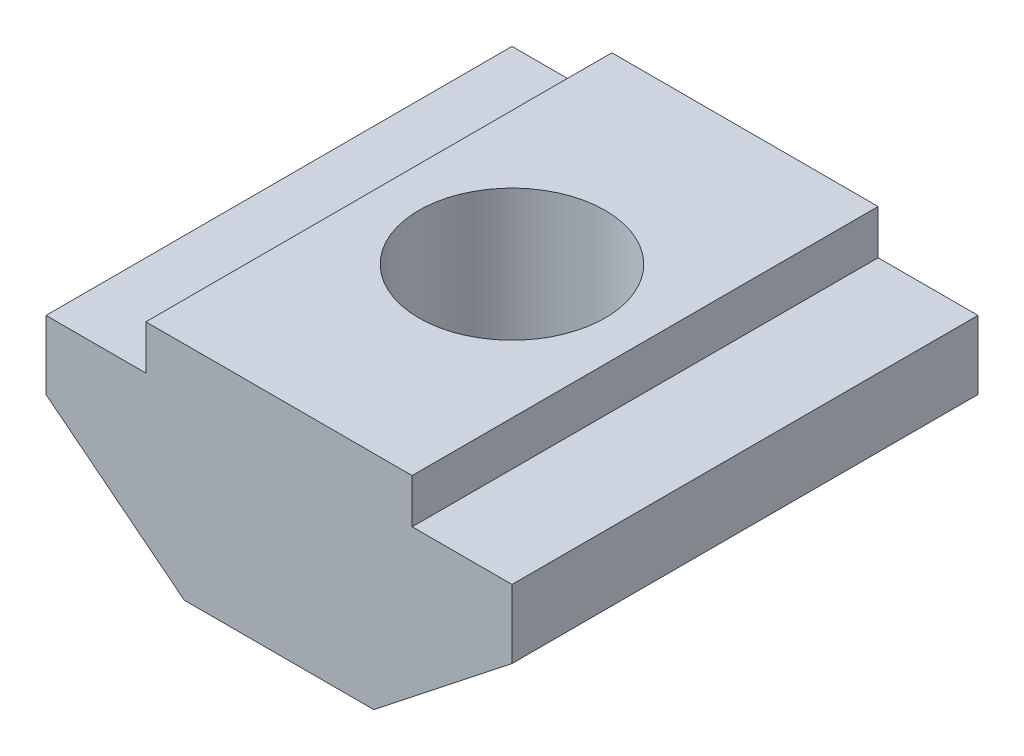
ISO-10303-21;
HEADER;
FILE_DESCRIPTION(('STEP AP214'),'2;1');
FILE_NAME('part.step','',(''),(''),'','','');
FILE_SCHEMA(('AUTOMOTIVE_DESIGN { 1 0 10303 214 1 1 1 1 }'));
ENDSEC;
DATA;
#1=APPLICATION_CONTEXT('core data for automotive mechanical design processes');
#2=APPLICATION_PROTOCOL_DEFINITION('international standard','automotive_design',2000,#1);
#3=PRODUCT_CONTEXT('',#1,'mechanical');
#4=PRODUCT('Part','Part','',(#3));
#5=PRODUCT_RELATED_PRODUCT_CATEGORY('part','',(#4));
#6=PRODUCT_DEFINITION_FORMATION('','',#4);
#7=PRODUCT_DEFINITION_CONTEXT('part definition',#1,'design');
#8=PRODUCT_DEFINITION('design','',#6,#7);
#9=PRODUCT_DEFINITION_SHAPE('','',#8);
#10=(LENGTH_UNIT() NAMED_UNIT(*) SI_UNIT(.MILLI.,.METRE.));
#11=(NAMED_UNIT(*) PLANE_ANGLE_UNIT() SI_UNIT($,.RADIAN.));
#12=(NAMED_UNIT(*) SI_UNIT($,.STERADIAN.) SOLID_ANGLE_UNIT());
#13=UNCERTAINTY_MEASURE_WITH_UNIT(LENGTH_MEASURE(1.E-05),#10,'distance_accuracy_value','');
#14=(GEOMETRIC_REPRESENTATION_CONTEXT(3) GLOBAL_UNCERTAINTY_ASSIGNED_CONTEXT((#13)) GLOBAL_UNIT_ASSIGNED_CONTEXT((#10,
#11,#12)) REPRESENTATION_CONTEXT('',''));
#15=CARTESIAN_POINT('',(0.,0.,0.));
#16=DIRECTION('',(0.,0.,1.));
#17=DIRECTION('',(1.,0.,0.));
#18=AXIS2_PLACEMENT_3D('',#15,#16,#17);
#19=CARTESIAN_POINT('',(3.,5.,10.5));
#20=DIRECTION('',(-1.,0.,0.));
#21=DIRECTION('',(0.,-1.,0.));
#22=AXIS2_PLACEMENT_3D('',#19,#20,#21);
#23=PLANE('',#22);
#24=DIRECTION('',(0.,1.,0.));
#25=VECTOR('',#24,1.);
#26=CARTESIAN_POINT('',(3.,5.,0.));
#27=LINE('',#26,#25);
#28=CARTESIAN_POINT('',(3.,4.,0.));
#29=VERTEX_POINT('',#28);
#30=CARTESIAN_POINT('',(3.,5.,0.));
#31=VERTEX_POINT('',#30);
#32=EDGE_CURVE('E145',#29,#31,#27,.T.);
#33=ORIENTED_EDGE('',*,*,#32,.T.);
#34=DIRECTION('',(0.,0.,-1.));
#35=VECTOR('',#34,1.);
#36=CARTESIAN_POINT('',(3.,5.,10.5));
#37=LINE('',#36,#35);
#38=CARTESIAN_POINT('',(3.,5.,10.5));
#39=VERTEX_POINT('',#38);
#40=EDGE_CURVE('E11',#39,#31,#37,.T.);
#41=ORIENTED_EDGE('',*,*,#40,.F.);
#42=DIRECTION('',(0.,1.,0.));
#43=VECTOR('',#42,1.);
#44=CARTESIAN_POINT('',(3.,5.,10.5));
#45=LINE('',#44,#43);
#46=CARTESIAN_POINT('',(3.,4.,10.5));
#47=VERTEX_POINT('',#46);
#48=EDGE_CURVE('E164',#47,#39,#45,.T.);
#49=ORIENTED_EDGE('',*,*,#48,.F.);
#50=DIRECTION('',(0.,0.,-1.));
#51=VECTOR('',#50,1.);
#52=CARTESIAN_POINT('',(3.,4.,10.5));
#53=LINE('',#52,#51);
#54=EDGE_CURVE('E141',#47,#29,#53,.T.);
#55=ORIENTED_EDGE('',*,*,#54,.T.);
#56=EDGE_LOOP('',(#33,#41,#49,#55));
#57=FACE_BOUND('',#56,.T.);
#58=ADVANCED_FACE('F37',(#57),#23,.F.);
#59=CARTESIAN_POINT('',(-3.,5.,10.5));
#60=DIRECTION('',(0.,-1.,0.));
#61=DIRECTION('',(0.,0.,-1.));
#62=AXIS2_PLACEMENT_3D('',#59,#60,#61);
#63=PLANE('',#62);
#64=CARTESIAN_POINT('',(0.,5.,5.25));
#65=DIRECTION('',(0.,1.,0.));
#66=DIRECTION('',(0.,0.,1.));
#67=AXIS2_PLACEMENT_3D('',#64,#65,#66);
#68=CIRCLE('',#67,2.1);
#69=CARTESIAN_POINT('',(0.,5.,7.35));
#70=VERTEX_POINT('',#69);
#71=EDGE_CURVE('E213',#70,#70,#68,.T.);
#72=ORIENTED_EDGE('',*,*,#71,.F.);
#73=EDGE_LOOP('',(#72));
#74=FACE_BOUND('',#73,.T.);
#75=DIRECTION('',(-1.,0.,0.));
#76=VECTOR('',#75,1.);
#77=CARTESIAN_POINT('',(-3.,5.,0.));
#78=LINE('',#77,#76);
#79=CARTESIAN_POINT('',(-3.,5.,0.));
#80=VERTEX_POINT('',#79);
#81=EDGE_CURVE('E148',#31,#80,#78,.T.);
#82=ORIENTED_EDGE('',*,*,#81,.T.);
#83=DIRECTION('',(0.,0.,-1.));
#84=VECTOR('',#83,1.);
#85=CARTESIAN_POINT('',(-3.,5.,10.5));
#86=LINE('',#85,#84);
#87=CARTESIAN_POINT('',(-3.,5.,10.5));
#88=VERTEX_POINT('',#87);
#89=EDGE_CURVE('E45',#88,#80,#86,.T.);
#90=ORIENTED_EDGE('',*,*,#89,.F.);
#91=DIRECTION('',(-1.,0.,0.));
#92=VECTOR('',#91,1.);
#93=CARTESIAN_POINT('',(-3.,5.,10.5));
#94=LINE('',#93,#92);
#95=EDGE_CURVE('E102',#39,#88,#94,.T.);
#96=ORIENTED_EDGE('',*,*,#95,.F.);
#97=ORIENTED_EDGE('',*,*,#40,.T.);
#98=EDGE_LOOP('',(#82,#90,#96,#97));
#99=FACE_BOUND('',#98,.T.);
#100=ADVANCED_FACE('F219',(#74,#99),#63,.F.);
#101=CARTESIAN_POINT('',(-3.,5.,10.5));
#102=DIRECTION('',(1.,0.,0.));
#103=DIRECTION('',(0.,1.,0.));
#104=AXIS2_PLACEMENT_3D('',#101,#102,#103);
#105=PLANE('',#104);
#106=DIRECTION('',(0.,-1.,0.));
#107=VECTOR('',#106,1.);
#108=CARTESIAN_POINT('',(-3.,5.,0.));
#109=LINE('',#108,#107);
#110=CARTESIAN_POINT('',(-3.,4.,0.));
#111=VERTEX_POINT('',#110);
#112=EDGE_CURVE('E151',#80,#111,#109,.T.);
#113=ORIENTED_EDGE('',*,*,#112,.T.);
#114=DIRECTION('',(0.,0.,-1.));
#115=VECTOR('',#114,1.);
#116=CARTESIAN_POINT('',(-3.,4.,10.5));
#117=LINE('',#116,#115);
#118=CARTESIAN_POINT('',(-3.,4.,10.5));
#119=VERTEX_POINT('',#118);
#120=EDGE_CURVE('E177',#119,#111,#117,.T.);
#121=ORIENTED_EDGE('',*,*,#120,.F.);
#122=DIRECTION('',(0.,-1.,0.));
#123=VECTOR('',#122,1.);
#124=CARTESIAN_POINT('',(-3.,5.,10.5));
#125=LINE('',#124,#123);
#126=EDGE_CURVE('E185',#88,#119,#125,.T.);
#127=ORIENTED_EDGE('',*,*,#126,.F.);
#128=ORIENTED_EDGE('',*,*,#89,.T.);
#129=EDGE_LOOP('',(#113,#121,#127,#128));
#130=FACE_BOUND('',#129,.T.);
#131=ADVANCED_FACE('F183',(#130),#105,.F.);
#132=CARTESIAN_POINT('',(-3.,4.,10.5));
#133=DIRECTION('',(0.,-1.,0.));
#134=DIRECTION('',(0.,0.,-1.));
#135=AXIS2_PLACEMENT_3D('',#132,#133,#134);
#136=PLANE('',#135);
#137=DIRECTION('',(-1.,0.,0.));
#138=VECTOR('',#137,1.);
#139=CARTESIAN_POINT('',(-3.,4.,0.));
#140=LINE('',#139,#138);
#141=CARTESIAN_POINT('',(-5.25,4.,0.));
#142=VERTEX_POINT('',#141);
#143=EDGE_CURVE('E153',#111,#142,#140,.T.);
#144=ORIENTED_EDGE('',*,*,#143,.T.);
#145=DIRECTION('',(0.,0.,-1.));
#146=VECTOR('',#145,1.);
#147=CARTESIAN_POINT('',(-5.25,4.,10.5));
#148=LINE('',#147,#146);
#149=CARTESIAN_POINT('',(-5.25,4.,10.5));
#150=VERTEX_POINT('',#149);
#151=EDGE_CURVE('E174',#150,#142,#148,.T.);
#152=ORIENTED_EDGE('',*,*,#151,.F.);
#153=DIRECTION('',(-1.,0.,0.));
#154=VECTOR('',#153,1.);
#155=CARTESIAN_POINT('',(-3.,4.,10.5));
#156=LINE('',#155,#154);
#157=EDGE_CURVE('E203',#119,#150,#156,.T.);
#158=ORIENTED_EDGE('',*,*,#157,.F.);
#159=ORIENTED_EDGE('',*,*,#120,.T.);
#160=EDGE_LOOP('',(#144,#152,#158,#159));
#161=FACE_BOUND('',#160,.T.);
#162=ADVANCED_FACE('F194',(#161),#136,.F.);
#163=CARTESIAN_POINT('',(-5.25,4.,10.5));
#164=DIRECTION('',(1.,0.,0.));
#165=DIRECTION('',(0.,0.,-1.));
#166=AXIS2_PLACEMENT_3D('',#163,#164,#165);
#167=PLANE('',#166);
#168=DIRECTION('',(0.,-1.,0.));
#169=VECTOR('',#168,1.);
#170=CARTESIAN_POINT('',(-5.25,4.,0.));
#171=LINE('',#170,#169);
#172=CARTESIAN_POINT('',(-5.25,2.45593869111823,0.));
#173=VERTEX_POINT('',#172);
#174=EDGE_CURVE('E155',#142,#173,#171,.T.);
#175=ORIENTED_EDGE('',*,*,#174,.T.);
#176=DIRECTION('',(0.,0.,-1.));
#177=VECTOR('',#176,1.);
#178=CARTESIAN_POINT('',(-5.25,2.45593869111823,10.5));
#179=LINE('',#178,#177);
#180=CARTESIAN_POINT('',(-5.25,2.45593869111823,10.5));
#181=VERTEX_POINT('',#180);
#182=EDGE_CURVE('E171',#181,#173,#179,.T.);
#183=ORIENTED_EDGE('',*,*,#182,.F.);
#184=DIRECTION('',(0.,-1.,0.));
#185=VECTOR('',#184,1.);
#186=CARTESIAN_POINT('',(-5.25,4.,10.5));
#187=LINE('',#186,#185);
#188=EDGE_CURVE('E200',#150,#181,#187,.T.);
#189=ORIENTED_EDGE('',*,*,#188,.F.);
#190=ORIENTED_EDGE('',*,*,#151,.T.);
#191=EDGE_LOOP('',(#175,#183,#189,#190));
#192=FACE_BOUND('',#191,.T.);
#193=ADVANCED_FACE('F198',(#192),#167,.F.);
#194=CARTESIAN_POINT('',(-5.25,2.45593869111823,10.5));
#195=DIRECTION('',(0.619208751305956,0.78522641467676,0.));
#196=DIRECTION('',(-0.78522641467676,0.619208751305956,0.));
#197=AXIS2_PLACEMENT_3D('',#194,#195,#196);
#198=PLANE('',#197);
#199=DIRECTION('',(0.78522641467676,-0.619208751305956,0.));
#200=VECTOR('',#199,1.);
#201=CARTESIAN_POINT('',(-5.25,2.45593869111823,0.));
#202=LINE('',#201,#200);
#203=CARTESIAN_POINT('',(-2.13559322033898,0.,0.));
#204=VERTEX_POINT('',#203);
#205=EDGE_CURVE('E157',#173,#204,#202,.T.);
#206=ORIENTED_EDGE('',*,*,#205,.T.);
#207=DIRECTION('',(0.,0.,-1.));
#208=VECTOR('',#207,1.);
#209=CARTESIAN_POINT('',(-2.13559322033898,0.,10.5));
#210=LINE('',#209,#208);
#211=CARTESIAN_POINT('',(-2.13559322033898,0.,10.5));
#212=VERTEX_POINT('',#211);
#213=EDGE_CURVE('E168',#212,#204,#210,.T.);
#214=ORIENTED_EDGE('',*,*,#213,.F.);
#215=DIRECTION('',(0.78522641467676,-0.619208751305956,0.));
#216=VECTOR('',#215,1.);
#217=CARTESIAN_POINT('',(-5.25,2.45593869111823,10.5));
#218=LINE('',#217,#216);
#219=EDGE_CURVE('E202',#181,#212,#218,.T.);
#220=ORIENTED_EDGE('',*,*,#219,.F.);
#221=ORIENTED_EDGE('',*,*,#182,.T.);
#222=EDGE_LOOP('',(#206,#214,#220,#221));
#223=FACE_BOUND('',#222,.T.);
#224=ADVANCED_FACE('F229',(#223),#198,.F.);
#225=CARTESIAN_POINT('',(2.13559322033898,0.,10.5));
#226=DIRECTION('',(0.,1.,0.));
#227=DIRECTION('',(0.,0.,1.));
#228=AXIS2_PLACEMENT_3D('',#225,#226,#227);
#229=PLANE('',#228);
#230=CARTESIAN_POINT('',(0.,0.,5.25));
#231=DIRECTION('',(0.,1.,0.));
#232=DIRECTION('',(0.,0.,1.));
#233=AXIS2_PLACEMENT_3D('',#230,#231,#232);
#234=CIRCLE('',#233,2.1);
#235=CARTESIAN_POINT('',(0.,0.,7.35));
#236=VERTEX_POINT('',#235);
#237=EDGE_CURVE('E149',#236,#236,#234,.T.);
#238=ORIENTED_EDGE('',*,*,#237,.T.);
#239=EDGE_LOOP('',(#238));
#240=FACE_BOUND('',#239,.T.);
#241=DIRECTION('',(1.,0.,0.));
#242=VECTOR('',#241,1.);
#243=CARTESIAN_POINT('',(2.13559322033898,0.,0.));
#244=LINE('',#243,#242);
#245=CARTESIAN_POINT('',(2.13559322033898,0.,0.));
#246=VERTEX_POINT('',#245);
#247=EDGE_CURVE('E159',#204,#246,#244,.T.);
#248=ORIENTED_EDGE('',*,*,#247,.T.);
#249=DIRECTION('',(0.,0.,-1.));
#250=VECTOR('',#249,1.);
#251=CARTESIAN_POINT('',(2.13559322033898,0.,10.5));
#252=LINE('',#251,#250);
#253=CARTESIAN_POINT('',(2.13559322033898,0.,10.5));
#254=VERTEX_POINT('',#253);
#255=EDGE_CURVE('E136',#254,#246,#252,.T.);
#256=ORIENTED_EDGE('',*,*,#255,.F.);
#257=DIRECTION('',(1.,0.,0.));
#258=VECTOR('',#257,1.);
#259=CARTESIAN_POINT('',(2.13559322033898,0.,10.5));
#260=LINE('',#259,#258);
#261=EDGE_CURVE('E127',#212,#254,#260,.T.);
#262=ORIENTED_EDGE('',*,*,#261,.F.);
#263=ORIENTED_EDGE('',*,*,#213,.T.);
#264=EDGE_LOOP('',(#248,#256,#262,#263));
#265=FACE_BOUND('',#264,.T.);
#266=ADVANCED_FACE('F226',(#240,#265),#229,.F.);
#267=CARTESIAN_POINT('',(5.25,2.45593869111823,10.5));
#268=DIRECTION('',(-0.619208751305956,0.78522641467676,0.));
#269=DIRECTION('',(-0.78522641467676,-0.619208751305956,0.));
#270=AXIS2_PLACEMENT_3D('',#267,#268,#269);
#271=PLANE('',#270);
#272=DIRECTION('',(0.78522641467676,0.619208751305956,0.));
#273=VECTOR('',#272,1.);
#274=CARTESIAN_POINT('',(5.25,2.45593869111823,0.));
#275=LINE('',#274,#273);
#276=CARTESIAN_POINT('',(5.25,2.45593869111823,0.));
#277=VERTEX_POINT('',#276);
#278=EDGE_CURVE('E135',#246,#277,#275,.T.);
#279=ORIENTED_EDGE('',*,*,#278,.T.);
#280=DIRECTION('',(0.,0.,-1.));
#281=VECTOR('',#280,1.);
#282=CARTESIAN_POINT('',(5.25,2.45593869111823,10.5));
#283=LINE('',#282,#281);
#284=CARTESIAN_POINT('',(5.25,2.45593869111823,10.5));
#285=VERTEX_POINT('',#284);
#286=EDGE_CURVE('E132',#285,#277,#283,.T.);
#287=ORIENTED_EDGE('',*,*,#286,.F.);
#288=DIRECTION('',(0.78522641467676,0.619208751305956,0.));
#289=VECTOR('',#288,1.);
#290=CARTESIAN_POINT('',(5.25,2.45593869111823,10.5));
#291=LINE('',#290,#289);
#292=EDGE_CURVE('E121',#254,#285,#291,.T.);
#293=ORIENTED_EDGE('',*,*,#292,.F.);
#294=ORIENTED_EDGE('',*,*,#255,.T.);
#295=EDGE_LOOP('',(#279,#287,#293,#294));
#296=FACE_BOUND('',#295,.T.);
#297=ADVANCED_FACE('F133',(#296),#271,.F.);
#298=CARTESIAN_POINT('',(5.25,4.,10.5));
#299=DIRECTION('',(-1.,0.,0.));
#300=DIRECTION('',(0.,0.,1.));
#301=AXIS2_PLACEMENT_3D('',#298,#299,#300);
#302=PLANE('',#301);
#303=DIRECTION('',(0.,1.,0.));
#304=VECTOR('',#303,1.);
#305=CARTESIAN_POINT('',(5.25,4.,0.));
#306=LINE('',#305,#304);
#307=CARTESIAN_POINT('',(5.25,4.,0.));
#308=VERTEX_POINT('',#307);
#309=EDGE_CURVE('E88',#277,#308,#306,.T.);
#310=ORIENTED_EDGE('',*,*,#309,.T.);
#311=DIRECTION('',(0.,0.,-1.));
#312=VECTOR('',#311,1.);
#313=CARTESIAN_POINT('',(5.25,4.,10.5));
#314=LINE('',#313,#312);
#315=CARTESIAN_POINT('',(5.25,4.,10.5));
#316=VERTEX_POINT('',#315);
#317=EDGE_CURVE('E137',#316,#308,#314,.T.);
#318=ORIENTED_EDGE('',*,*,#317,.F.);
#319=DIRECTION('',(0.,1.,0.));
#320=VECTOR('',#319,1.);
#321=CARTESIAN_POINT('',(5.25,4.,10.5));
#322=LINE('',#321,#320);
#323=EDGE_CURVE('E125',#285,#316,#322,.T.);
#324=ORIENTED_EDGE('',*,*,#323,.F.);
#325=ORIENTED_EDGE('',*,*,#286,.T.);
#326=EDGE_LOOP('',(#310,#318,#324,#325));
#327=FACE_BOUND('',#326,.T.);
#328=ADVANCED_FACE('F139',(#327),#302,.F.);
#329=CARTESIAN_POINT('',(3.,4.,10.5));
#330=DIRECTION('',(0.,-1.,0.));
#331=DIRECTION('',(0.,0.,-1.));
#332=AXIS2_PLACEMENT_3D('',#329,#330,#331);
#333=PLANE('',#332);
#334=DIRECTION('',(-1.,0.,0.));
#335=VECTOR('',#334,1.);
#336=CARTESIAN_POINT('',(3.,4.,0.));
#337=LINE('',#336,#335);
#338=EDGE_CURVE('E94',#308,#29,#337,.T.);
#339=ORIENTED_EDGE('',*,*,#338,.T.);
#340=ORIENTED_EDGE('',*,*,#54,.F.);
#341=DIRECTION('',(-1.,0.,0.));
#342=VECTOR('',#341,1.);
#343=CARTESIAN_POINT('',(3.,4.,10.5));
#344=LINE('',#343,#342);
#345=EDGE_CURVE('E53',#316,#47,#344,.T.);
#346=ORIENTED_EDGE('',*,*,#345,.F.);
#347=ORIENTED_EDGE('',*,*,#317,.T.);
#348=EDGE_LOOP('',(#339,#340,#346,#347));
#349=FACE_BOUND('',#348,.T.);
#350=ADVANCED_FACE('F285',(#349),#333,.F.);
#351=CARTESIAN_POINT('',(0.,0.,10.5));
#352=DIRECTION('',(0.,0.,1.));
#353=DIRECTION('',(1.,0.,0.));
#354=AXIS2_PLACEMENT_3D('',#351,#352,#353);
#355=PLANE('',#354);
#356=ORIENTED_EDGE('',*,*,#48,.T.);
#357=ORIENTED_EDGE('',*,*,#95,.T.);
#358=ORIENTED_EDGE('',*,*,#126,.T.);
#359=ORIENTED_EDGE('',*,*,#157,.T.);
#360=ORIENTED_EDGE('',*,*,#188,.T.);
#361=ORIENTED_EDGE('',*,*,#219,.T.);
#362=ORIENTED_EDGE('',*,*,#261,.T.);
#363=ORIENTED_EDGE('',*,*,#292,.T.);
#364=ORIENTED_EDGE('',*,*,#323,.T.);
#365=ORIENTED_EDGE('',*,*,#345,.T.);
#366=EDGE_LOOP('',(#356,#357,#358,#359,#360,#361,#362,#363,#364,#365));
#367=FACE_BOUND('',#366,.T.);
#368=ADVANCED_FACE('F123',(#367),#355,.T.);
#369=CARTESIAN_POINT('',(0.,0.,0.));
#370=DIRECTION('',(0.,0.,1.));
#371=DIRECTION('',(1.,0.,0.));
#372=AXIS2_PLACEMENT_3D('',#369,#370,#371);
#373=PLANE('',#372);
#374=ORIENTED_EDGE('',*,*,#32,.F.);
#375=ORIENTED_EDGE('',*,*,#338,.F.);
#376=ORIENTED_EDGE('',*,*,#309,.F.);
#377=ORIENTED_EDGE('',*,*,#278,.F.);
#378=ORIENTED_EDGE('',*,*,#247,.F.);
#379=ORIENTED_EDGE('',*,*,#205,.F.);
#380=ORIENTED_EDGE('',*,*,#174,.F.);
#381=ORIENTED_EDGE('',*,*,#143,.F.);
#382=ORIENTED_EDGE('',*,*,#112,.F.);
#383=ORIENTED_EDGE('',*,*,#81,.F.);
#384=EDGE_LOOP('',(#374,#375,#376,#377,#378,#379,#380,#381,#382,#383));
#385=FACE_BOUND('',#384,.T.);
#386=ADVANCED_FACE('F189',(#385),#373,.F.);
#387=CARTESIAN_POINT('',(0.,5.,5.25));
#388=DIRECTION('',(0.,1.,0.));
#389=DIRECTION('',(0.,0.,1.));
#390=AXIS2_PLACEMENT_3D('',#387,#388,#389);
#391=CYLINDRICAL_SURFACE('',#390,2.1);
#392=ORIENTED_EDGE('',*,*,#237,.F.);
#393=EDGE_LOOP('',(#392));
#394=FACE_BOUND('',#393,.T.);
#395=ORIENTED_EDGE('',*,*,#71,.T.);
#396=EDGE_LOOP('',(#395));
#397=FACE_BOUND('',#396,.T.);
#398=ADVANCED_FACE('F217',(#394,#397),#391,.F.);
#399=CLOSED_SHELL('',(#58,#100,#131,#162,#193,#224,#266,#297,#328,#350,#368,#386,#398));
#400=MANIFOLD_SOLID_BREP('B2',#399);
#401=ADVANCED_BREP_SHAPE_REPRESENTATION('',(#18,#400),#14);
#402=SHAPE_DEFINITION_REPRESENTATION(#9,#401);
ENDSEC;
END-ISO-10303-21;
